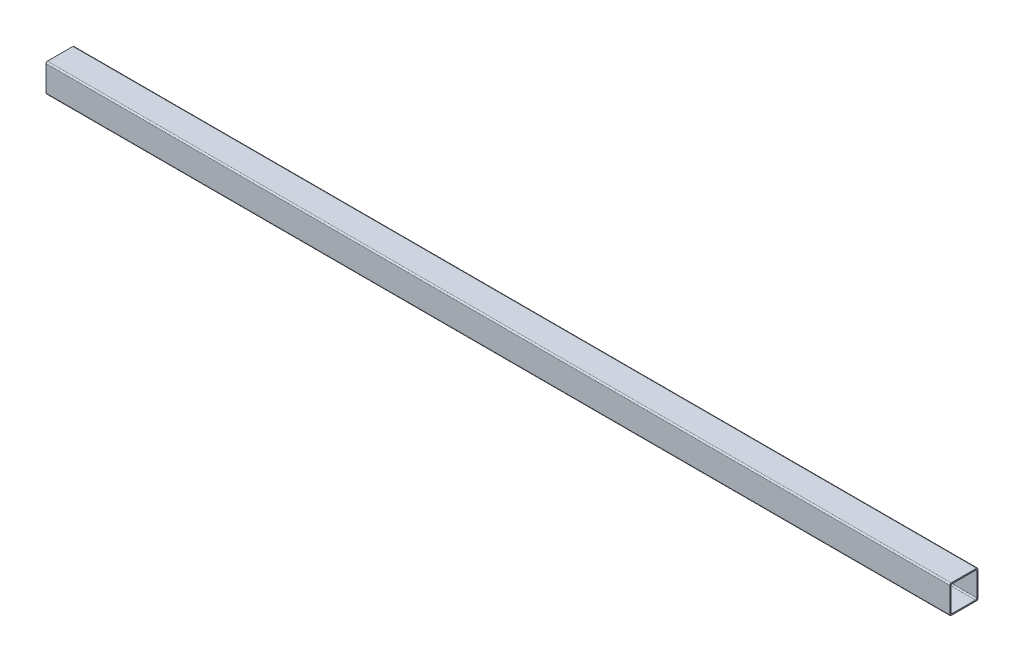
ISO-10303-21;
HEADER;
FILE_DESCRIPTION(('STEP AP214'),'2;1');
FILE_NAME('part.step','',(''),(''),'','','');
FILE_SCHEMA(('AUTOMOTIVE_DESIGN { 1 0 10303 214 1 1 1 1 }'));
ENDSEC;
DATA;
#1=APPLICATION_CONTEXT('core data for automotive mechanical design processes');
#2=APPLICATION_PROTOCOL_DEFINITION('international standard','automotive_design',2000,#1);
#3=PRODUCT_CONTEXT('',#1,'mechanical');
#4=PRODUCT('Part','Part','',(#3));
#5=PRODUCT_RELATED_PRODUCT_CATEGORY('part','',(#4));
#6=PRODUCT_DEFINITION_FORMATION('','',#4);
#7=PRODUCT_DEFINITION_CONTEXT('part definition',#1,'design');
#8=PRODUCT_DEFINITION('design','',#6,#7);
#9=PRODUCT_DEFINITION_SHAPE('','',#8);
#10=(LENGTH_UNIT() NAMED_UNIT(*) SI_UNIT(.MILLI.,.METRE.));
#11=(NAMED_UNIT(*) PLANE_ANGLE_UNIT() SI_UNIT($,.RADIAN.));
#12=(NAMED_UNIT(*) SI_UNIT($,.STERADIAN.) SOLID_ANGLE_UNIT());
#13=UNCERTAINTY_MEASURE_WITH_UNIT(LENGTH_MEASURE(1.E-05),#10,'distance_accuracy_value','');
#14=(GEOMETRIC_REPRESENTATION_CONTEXT(3) GLOBAL_UNCERTAINTY_ASSIGNED_CONTEXT((#13)) GLOBAL_UNIT_ASSIGNED_CONTEXT((#10,
#11,#12)) REPRESENTATION_CONTEXT('',''));
#15=CARTESIAN_POINT('',(0.,0.,0.));
#16=DIRECTION('',(0.,0.,1.));
#17=DIRECTION('',(1.,0.,0.));
#18=AXIS2_PLACEMENT_3D('',#15,#16,#17);
#19=CARTESIAN_POINT('',(914.4,-17.145,-17.145));
#20=DIRECTION('',(1.,0.,0.));
#21=DIRECTION('',(0.,0.,-1.));
#22=AXIS2_PLACEMENT_3D('',#19,#20,#21);
#23=PLANE('',#22);
#24=CARTESIAN_POINT('',(914.4,-17.145,-17.145));
#25=DIRECTION('',(1.,0.,0.));
#26=DIRECTION('',(0.,0.,-1.));
#27=AXIS2_PLACEMENT_3D('',#24,#25,#26);
#28=CIRCLE('',#27,1.905);
#29=CARTESIAN_POINT('',(914.4,-19.05,-17.145));
#30=VERTEX_POINT('',#29);
#31=CARTESIAN_POINT('',(914.4,-17.145,-19.05));
#32=VERTEX_POINT('',#31);
#33=EDGE_CURVE('E218',#30,#32,#28,.T.);
#34=ORIENTED_EDGE('',*,*,#33,.T.);
#35=DIRECTION('',(0.,1.,0.));
#36=VECTOR('',#35,1.);
#37=CARTESIAN_POINT('',(914.4,-17.145,-19.05));
#38=LINE('',#37,#36);
#39=CARTESIAN_POINT('',(914.4,17.145,-19.05));
#40=VERTEX_POINT('',#39);
#41=EDGE_CURVE('E214',#32,#40,#38,.T.);
#42=ORIENTED_EDGE('',*,*,#41,.T.);
#43=CARTESIAN_POINT('',(914.4,17.145,-17.145));
#44=DIRECTION('',(1.,0.,0.));
#45=DIRECTION('',(0.,0.,-1.));
#46=AXIS2_PLACEMENT_3D('',#43,#44,#45);
#47=CIRCLE('',#46,1.905);
#48=CARTESIAN_POINT('',(914.4,19.05,-17.145));
#49=VERTEX_POINT('',#48);
#50=EDGE_CURVE('E288',#40,#49,#47,.T.);
#51=ORIENTED_EDGE('',*,*,#50,.T.);
#52=DIRECTION('',(0.,0.,1.));
#53=VECTOR('',#52,1.);
#54=CARTESIAN_POINT('',(914.4,19.05,-17.145));
#55=LINE('',#54,#53);
#56=CARTESIAN_POINT('',(914.4,19.05,17.145));
#57=VERTEX_POINT('',#56);
#58=EDGE_CURVE('E291',#49,#57,#55,.T.);
#59=ORIENTED_EDGE('',*,*,#58,.T.);
#60=CARTESIAN_POINT('',(914.4,17.145,17.145));
#61=DIRECTION('',(1.,0.,0.));
#62=DIRECTION('',(0.,0.,-1.));
#63=AXIS2_PLACEMENT_3D('',#60,#61,#62);
#64=CIRCLE('',#63,1.905);
#65=CARTESIAN_POINT('',(914.4,17.145,19.05));
#66=VERTEX_POINT('',#65);
#67=EDGE_CURVE('E294',#57,#66,#64,.T.);
#68=ORIENTED_EDGE('',*,*,#67,.T.);
#69=DIRECTION('',(0.,-1.,0.));
#70=VECTOR('',#69,1.);
#71=CARTESIAN_POINT('',(914.4,-17.145,19.05));
#72=LINE('',#71,#70);
#73=CARTESIAN_POINT('',(914.4,-17.145,19.05));
#74=VERTEX_POINT('',#73);
#75=EDGE_CURVE('E297',#66,#74,#72,.T.);
#76=ORIENTED_EDGE('',*,*,#75,.T.);
#77=CARTESIAN_POINT('',(914.4,-17.145,17.145));
#78=DIRECTION('',(1.,0.,0.));
#79=DIRECTION('',(0.,0.,-1.));
#80=AXIS2_PLACEMENT_3D('',#77,#78,#79);
#81=CIRCLE('',#80,1.905);
#82=CARTESIAN_POINT('',(914.4,-19.05,17.145));
#83=VERTEX_POINT('',#82);
#84=EDGE_CURVE('E300',#74,#83,#81,.T.);
#85=ORIENTED_EDGE('',*,*,#84,.T.);
#86=DIRECTION('',(0.,0.,-1.));
#87=VECTOR('',#86,1.);
#88=CARTESIAN_POINT('',(914.4,-19.05,-17.145));
#89=LINE('',#88,#87);
#90=EDGE_CURVE('E181',#83,#30,#89,.T.);
#91=ORIENTED_EDGE('',*,*,#90,.T.);
#92=EDGE_LOOP('',(#34,#42,#51,#59,#68,#76,#85,#91));
#93=FACE_BOUND('',#92,.T.);
#94=DIRECTION('',(0.,0.,1.));
#95=VECTOR('',#94,1.);
#96=CARTESIAN_POINT('',(914.4,17.399,-15.6591));
#97=LINE('',#96,#95);
#98=CARTESIAN_POINT('',(914.4,17.399,-15.6591));
#99=VERTEX_POINT('',#98);
#100=CARTESIAN_POINT('',(914.4,17.399,15.6591));
#101=VERTEX_POINT('',#100);
#102=EDGE_CURVE('E225',#99,#101,#97,.T.);
#103=ORIENTED_EDGE('',*,*,#102,.F.);
#104=CARTESIAN_POINT('',(914.4,15.6591,-15.6591));
#105=DIRECTION('',(1.,0.,0.));
#106=DIRECTION('',(0.,0.,-1.));
#107=AXIS2_PLACEMENT_3D('',#104,#105,#106);
#108=CIRCLE('',#107,1.7399);
#109=CARTESIAN_POINT('',(914.4,15.6591,-17.399));
#110=VERTEX_POINT('',#109);
#111=EDGE_CURVE('E220',#110,#99,#108,.T.);
#112=ORIENTED_EDGE('',*,*,#111,.F.);
#113=DIRECTION('',(0.,1.,0.));
#114=VECTOR('',#113,1.);
#115=CARTESIAN_POINT('',(914.4,15.6591,-17.399));
#116=LINE('',#115,#114);
#117=CARTESIAN_POINT('',(914.4,-15.6591,-17.399));
#118=VERTEX_POINT('',#117);
#119=EDGE_CURVE('E249',#118,#110,#116,.T.);
#120=ORIENTED_EDGE('',*,*,#119,.F.);
#121=CARTESIAN_POINT('',(914.4,-15.6591,-15.6591));
#122=DIRECTION('',(1.,0.,0.));
#123=DIRECTION('',(0.,0.,-1.));
#124=AXIS2_PLACEMENT_3D('',#121,#122,#123);
#125=CIRCLE('',#124,1.7399);
#126=CARTESIAN_POINT('',(914.4,-17.399,-15.6591));
#127=VERTEX_POINT('',#126);
#128=EDGE_CURVE('E245',#127,#118,#125,.T.);
#129=ORIENTED_EDGE('',*,*,#128,.F.);
#130=DIRECTION('',(0.,0.,-1.));
#131=VECTOR('',#130,1.);
#132=CARTESIAN_POINT('',(914.4,-17.399,-15.6591));
#133=LINE('',#132,#131);
#134=CARTESIAN_POINT('',(914.4,-17.399,15.6591));
#135=VERTEX_POINT('',#134);
#136=EDGE_CURVE('E242',#135,#127,#133,.T.);
#137=ORIENTED_EDGE('',*,*,#136,.F.);
#138=CARTESIAN_POINT('',(914.4,-15.6591,15.6591));
#139=DIRECTION('',(1.,0.,0.));
#140=DIRECTION('',(0.,0.,-1.));
#141=AXIS2_PLACEMENT_3D('',#138,#139,#140);
#142=CIRCLE('',#141,1.7399);
#143=CARTESIAN_POINT('',(914.4,-15.6591,17.399));
#144=VERTEX_POINT('',#143);
#145=EDGE_CURVE('E239',#144,#135,#142,.T.);
#146=ORIENTED_EDGE('',*,*,#145,.F.);
#147=DIRECTION('',(0.,-1.,0.));
#148=VECTOR('',#147,1.);
#149=CARTESIAN_POINT('',(914.4,15.6591,17.399));
#150=LINE('',#149,#148);
#151=CARTESIAN_POINT('',(914.4,15.6591,17.399));
#152=VERTEX_POINT('',#151);
#153=EDGE_CURVE('E236',#152,#144,#150,.T.);
#154=ORIENTED_EDGE('',*,*,#153,.F.);
#155=CARTESIAN_POINT('',(914.4,15.6591,15.6591));
#156=DIRECTION('',(1.,0.,0.));
#157=DIRECTION('',(0.,0.,-1.));
#158=AXIS2_PLACEMENT_3D('',#155,#156,#157);
#159=CIRCLE('',#158,1.73990000000001);
#160=EDGE_CURVE('E233',#101,#152,#159,.T.);
#161=ORIENTED_EDGE('',*,*,#160,.F.);
#162=EDGE_LOOP('',(#103,#112,#120,#129,#137,#146,#154,#161));
#163=FACE_BOUND('',#162,.T.);
#164=ADVANCED_FACE('F45',(#93,#163),#23,.T.);
#165=CARTESIAN_POINT('',(914.4,-17.145,-17.145));
#166=DIRECTION('',(-1.,0.,0.));
#167=DIRECTION('',(0.,0.,1.));
#168=AXIS2_PLACEMENT_3D('',#165,#166,#167);
#169=CYLINDRICAL_SURFACE('',#168,1.905);
#170=DIRECTION('',(-1.,0.,0.));
#171=VECTOR('',#170,1.);
#172=CARTESIAN_POINT('',(914.4,-19.05,-17.145));
#173=LINE('',#172,#171);
#174=CARTESIAN_POINT('',(-304.8,-19.05,-17.145));
#175=VERTEX_POINT('',#174);
#176=EDGE_CURVE('E183',#30,#175,#173,.T.);
#177=ORIENTED_EDGE('',*,*,#176,.T.);
#178=CARTESIAN_POINT('',(-304.8,-17.145,-17.145));
#179=DIRECTION('',(1.,0.,0.));
#180=DIRECTION('',(0.,0.,-1.));
#181=AXIS2_PLACEMENT_3D('',#178,#179,#180);
#182=CIRCLE('',#181,1.905);
#183=CARTESIAN_POINT('',(-304.8,-17.145,-19.05));
#184=VERTEX_POINT('',#183);
#185=EDGE_CURVE('E61',#175,#184,#182,.T.);
#186=ORIENTED_EDGE('',*,*,#185,.T.);
#187=DIRECTION('',(-1.,0.,0.));
#188=VECTOR('',#187,1.);
#189=CARTESIAN_POINT('',(914.4,-17.145,-19.05));
#190=LINE('',#189,#188);
#191=EDGE_CURVE('E54',#32,#184,#190,.T.);
#192=ORIENTED_EDGE('',*,*,#191,.F.);
#193=ORIENTED_EDGE('',*,*,#33,.F.);
#194=EDGE_LOOP('',(#177,#186,#192,#193));
#195=FACE_BOUND('',#194,.T.);
#196=ADVANCED_FACE('F47',(#195),#169,.T.);
#197=CARTESIAN_POINT('',(914.4,-17.145,-19.05));
#198=DIRECTION('',(0.,0.,1.));
#199=DIRECTION('',(1.,0.,0.));
#200=AXIS2_PLACEMENT_3D('',#197,#198,#199);
#201=PLANE('',#200);
#202=ORIENTED_EDGE('',*,*,#191,.T.);
#203=DIRECTION('',(0.,-1.,0.));
#204=VECTOR('',#203,1.);
#205=CARTESIAN_POINT('',(-304.8,19.05,-19.05));
#206=LINE('',#205,#204);
#207=CARTESIAN_POINT('',(-304.8,17.145,-19.05));
#208=VERTEX_POINT('',#207);
#209=EDGE_CURVE('E213',#208,#184,#206,.T.);
#210=ORIENTED_EDGE('',*,*,#209,.F.);
#211=DIRECTION('',(-1.,0.,0.));
#212=VECTOR('',#211,1.);
#213=CARTESIAN_POINT('',(914.4,17.145,-19.05));
#214=LINE('',#213,#212);
#215=EDGE_CURVE('E203',#40,#208,#214,.T.);
#216=ORIENTED_EDGE('',*,*,#215,.F.);
#217=ORIENTED_EDGE('',*,*,#41,.F.);
#218=EDGE_LOOP('',(#202,#210,#216,#217));
#219=FACE_BOUND('',#218,.T.);
#220=ADVANCED_FACE('F211',(#219),#201,.F.);
#221=CARTESIAN_POINT('',(914.4,17.145,-17.145));
#222=DIRECTION('',(-1.,0.,0.));
#223=DIRECTION('',(0.,0.,1.));
#224=AXIS2_PLACEMENT_3D('',#221,#222,#223);
#225=CYLINDRICAL_SURFACE('',#224,1.905);
#226=ORIENTED_EDGE('',*,*,#215,.T.);
#227=CARTESIAN_POINT('',(-304.8,17.145,-17.145));
#228=DIRECTION('',(1.,0.,0.));
#229=DIRECTION('',(0.,0.,-1.));
#230=AXIS2_PLACEMENT_3D('',#227,#228,#229);
#231=CIRCLE('',#230,1.905);
#232=CARTESIAN_POINT('',(-304.8,19.05,-17.145));
#233=VERTEX_POINT('',#232);
#234=EDGE_CURVE('E221',#208,#233,#231,.T.);
#235=ORIENTED_EDGE('',*,*,#234,.T.);
#236=DIRECTION('',(-1.,0.,0.));
#237=VECTOR('',#236,1.);
#238=CARTESIAN_POINT('',(914.4,19.05,-17.145));
#239=LINE('',#238,#237);
#240=EDGE_CURVE('E199',#49,#233,#239,.T.);
#241=ORIENTED_EDGE('',*,*,#240,.F.);
#242=ORIENTED_EDGE('',*,*,#50,.F.);
#243=EDGE_LOOP('',(#226,#235,#241,#242));
#244=FACE_BOUND('',#243,.T.);
#245=ADVANCED_FACE('F348',(#244),#225,.T.);
#246=CARTESIAN_POINT('',(914.4,19.05,-17.145));
#247=DIRECTION('',(0.,-1.,0.));
#248=DIRECTION('',(0.,0.,-1.));
#249=AXIS2_PLACEMENT_3D('',#246,#247,#248);
#250=PLANE('',#249);
#251=ORIENTED_EDGE('',*,*,#240,.T.);
#252=DIRECTION('',(0.,0.,1.));
#253=VECTOR('',#252,1.);
#254=CARTESIAN_POINT('',(-304.8,19.05,-19.05));
#255=LINE('',#254,#253);
#256=CARTESIAN_POINT('',(-304.8,19.05,17.145));
#257=VERTEX_POINT('',#256);
#258=EDGE_CURVE('E165',#233,#257,#255,.T.);
#259=ORIENTED_EDGE('',*,*,#258,.T.);
#260=DIRECTION('',(-1.,0.,0.));
#261=VECTOR('',#260,1.);
#262=CARTESIAN_POINT('',(914.4,19.05,17.145));
#263=LINE('',#262,#261);
#264=EDGE_CURVE('E195',#57,#257,#263,.T.);
#265=ORIENTED_EDGE('',*,*,#264,.F.);
#266=ORIENTED_EDGE('',*,*,#58,.F.);
#267=EDGE_LOOP('',(#251,#259,#265,#266));
#268=FACE_BOUND('',#267,.T.);
#269=ADVANCED_FACE('F342',(#268),#250,.F.);
#270=CARTESIAN_POINT('',(914.4,17.145,17.145));
#271=DIRECTION('',(-1.,0.,0.));
#272=DIRECTION('',(0.,0.,1.));
#273=AXIS2_PLACEMENT_3D('',#270,#271,#272);
#274=CYLINDRICAL_SURFACE('',#273,1.905);
#275=ORIENTED_EDGE('',*,*,#264,.T.);
#276=CARTESIAN_POINT('',(-304.8,17.145,17.145));
#277=DIRECTION('',(1.,0.,0.));
#278=DIRECTION('',(0.,0.,-1.));
#279=AXIS2_PLACEMENT_3D('',#276,#277,#278);
#280=CIRCLE('',#279,1.905);
#281=CARTESIAN_POINT('',(-304.8,17.145,19.05));
#282=VERTEX_POINT('',#281);
#283=EDGE_CURVE('E177',#257,#282,#280,.T.);
#284=ORIENTED_EDGE('',*,*,#283,.T.);
#285=DIRECTION('',(-1.,0.,0.));
#286=VECTOR('',#285,1.);
#287=CARTESIAN_POINT('',(914.4,17.145,19.05));
#288=LINE('',#287,#286);
#289=EDGE_CURVE('E187',#66,#282,#288,.T.);
#290=ORIENTED_EDGE('',*,*,#289,.F.);
#291=ORIENTED_EDGE('',*,*,#67,.F.);
#292=EDGE_LOOP('',(#275,#284,#290,#291));
#293=FACE_BOUND('',#292,.T.);
#294=ADVANCED_FACE('F338',(#293),#274,.T.);
#295=CARTESIAN_POINT('',(914.4,-17.145,19.05));
#296=DIRECTION('',(0.,0.,-1.));
#297=DIRECTION('',(-1.,0.,0.));
#298=AXIS2_PLACEMENT_3D('',#295,#296,#297);
#299=PLANE('',#298);
#300=ORIENTED_EDGE('',*,*,#289,.T.);
#301=DIRECTION('',(0.,-1.,0.));
#302=VECTOR('',#301,1.);
#303=CARTESIAN_POINT('',(-304.8,19.05,19.05));
#304=LINE('',#303,#302);
#305=CARTESIAN_POINT('',(-304.8,-17.145,19.05));
#306=VERTEX_POINT('',#305);
#307=EDGE_CURVE('E310',#282,#306,#304,.T.);
#308=ORIENTED_EDGE('',*,*,#307,.T.);
#309=DIRECTION('',(-1.,0.,0.));
#310=VECTOR('',#309,1.);
#311=CARTESIAN_POINT('',(914.4,-17.145,19.05));
#312=LINE('',#311,#310);
#313=EDGE_CURVE('E175',#74,#306,#312,.T.);
#314=ORIENTED_EDGE('',*,*,#313,.F.);
#315=ORIENTED_EDGE('',*,*,#75,.F.);
#316=EDGE_LOOP('',(#300,#308,#314,#315));
#317=FACE_BOUND('',#316,.T.);
#318=ADVANCED_FACE('F309',(#317),#299,.F.);
#319=CARTESIAN_POINT('',(914.4,-17.145,17.145));
#320=DIRECTION('',(-1.,0.,0.));
#321=DIRECTION('',(0.,0.,1.));
#322=AXIS2_PLACEMENT_3D('',#319,#320,#321);
#323=CYLINDRICAL_SURFACE('',#322,1.905);
#324=ORIENTED_EDGE('',*,*,#313,.T.);
#325=CARTESIAN_POINT('',(-304.8,-17.145,17.145));
#326=DIRECTION('',(1.,0.,0.));
#327=DIRECTION('',(0.,0.,-1.));
#328=AXIS2_PLACEMENT_3D('',#325,#326,#327);
#329=CIRCLE('',#328,1.905);
#330=CARTESIAN_POINT('',(-304.8,-19.05,17.145));
#331=VERTEX_POINT('',#330);
#332=EDGE_CURVE('E158',#306,#331,#329,.T.);
#333=ORIENTED_EDGE('',*,*,#332,.T.);
#334=DIRECTION('',(-1.,0.,0.));
#335=VECTOR('',#334,1.);
#336=CARTESIAN_POINT('',(914.4,-19.05,17.145));
#337=LINE('',#336,#335);
#338=EDGE_CURVE('E172',#83,#331,#337,.T.);
#339=ORIENTED_EDGE('',*,*,#338,.F.);
#340=ORIENTED_EDGE('',*,*,#84,.F.);
#341=EDGE_LOOP('',(#324,#333,#339,#340));
#342=FACE_BOUND('',#341,.T.);
#343=ADVANCED_FACE('F170',(#342),#323,.T.);
#344=CARTESIAN_POINT('',(914.4,-19.05,-17.145));
#345=DIRECTION('',(0.,1.,0.));
#346=DIRECTION('',(0.,0.,1.));
#347=AXIS2_PLACEMENT_3D('',#344,#345,#346);
#348=PLANE('',#347);
#349=ORIENTED_EDGE('',*,*,#338,.T.);
#350=DIRECTION('',(0.,0.,1.));
#351=VECTOR('',#350,1.);
#352=CARTESIAN_POINT('',(-304.8,-19.05,-19.05));
#353=LINE('',#352,#351);
#354=EDGE_CURVE('E155',#175,#331,#353,.T.);
#355=ORIENTED_EDGE('',*,*,#354,.F.);
#356=ORIENTED_EDGE('',*,*,#176,.F.);
#357=ORIENTED_EDGE('',*,*,#90,.F.);
#358=EDGE_LOOP('',(#349,#355,#356,#357));
#359=FACE_BOUND('',#358,.T.);
#360=ADVANCED_FACE('F180',(#359),#348,.F.);
#361=CARTESIAN_POINT('',(914.4,15.6591,-15.6591));
#362=DIRECTION('',(-1.,0.,0.));
#363=DIRECTION('',(0.,0.,1.));
#364=AXIS2_PLACEMENT_3D('',#361,#362,#363);
#365=CYLINDRICAL_SURFACE('',#364,1.7399);
#366=CARTESIAN_POINT('',(-304.8,15.6591,-15.6591));
#367=DIRECTION('',(1.,0.,0.));
#368=DIRECTION('',(0.,0.,-1.));
#369=AXIS2_PLACEMENT_3D('',#366,#367,#368);
#370=CIRCLE('',#369,1.7399);
#371=CARTESIAN_POINT('',(-304.8,15.6591,-17.399));
#372=VERTEX_POINT('',#371);
#373=CARTESIAN_POINT('',(-304.8,17.399,-15.6591));
#374=VERTEX_POINT('',#373);
#375=EDGE_CURVE('E178',#372,#374,#370,.T.);
#376=ORIENTED_EDGE('',*,*,#375,.F.);
#377=DIRECTION('',(-1.,0.,0.));
#378=VECTOR('',#377,1.);
#379=CARTESIAN_POINT('',(914.4,15.6591,-17.399));
#380=LINE('',#379,#378);
#381=EDGE_CURVE('E252',#110,#372,#380,.T.);
#382=ORIENTED_EDGE('',*,*,#381,.F.);
#383=ORIENTED_EDGE('',*,*,#111,.T.);
#384=DIRECTION('',(-1.,0.,0.));
#385=VECTOR('',#384,1.);
#386=CARTESIAN_POINT('',(914.4,17.399,-15.6591));
#387=LINE('',#386,#385);
#388=EDGE_CURVE('E280',#99,#374,#387,.T.);
#389=ORIENTED_EDGE('',*,*,#388,.T.);
#390=EDGE_LOOP('',(#376,#382,#383,#389));
#391=FACE_BOUND('',#390,.T.);
#392=ADVANCED_FACE('F364',(#391),#365,.F.);
#393=CARTESIAN_POINT('',(914.4,17.399,-15.6591));
#394=DIRECTION('',(0.,-1.,0.));
#395=DIRECTION('',(0.,0.,-1.));
#396=AXIS2_PLACEMENT_3D('',#393,#394,#395);
#397=PLANE('',#396);
#398=DIRECTION('',(0.,0.,1.));
#399=VECTOR('',#398,1.);
#400=CARTESIAN_POINT('',(-304.8,17.399,-15.6591));
#401=LINE('',#400,#399);
#402=CARTESIAN_POINT('',(-304.8,17.399,15.6591));
#403=VERTEX_POINT('',#402);
#404=EDGE_CURVE('E332',#374,#403,#401,.T.);
#405=ORIENTED_EDGE('',*,*,#404,.F.);
#406=ORIENTED_EDGE('',*,*,#388,.F.);
#407=ORIENTED_EDGE('',*,*,#102,.T.);
#408=DIRECTION('',(-1.,0.,0.));
#409=VECTOR('',#408,1.);
#410=CARTESIAN_POINT('',(914.4,17.399,15.6591));
#411=LINE('',#410,#409);
#412=EDGE_CURVE('E276',#101,#403,#411,.T.);
#413=ORIENTED_EDGE('',*,*,#412,.T.);
#414=EDGE_LOOP('',(#405,#406,#407,#413));
#415=FACE_BOUND('',#414,.T.);
#416=ADVANCED_FACE('F395',(#415),#397,.T.);
#417=CARTESIAN_POINT('',(914.4,15.6591,15.6591));
#418=DIRECTION('',(-1.,0.,0.));
#419=DIRECTION('',(0.,0.,1.));
#420=AXIS2_PLACEMENT_3D('',#417,#418,#419);
#421=CYLINDRICAL_SURFACE('',#420,1.73990000000001);
#422=CARTESIAN_POINT('',(-304.8,15.6591,15.6591));
#423=DIRECTION('',(1.,0.,0.));
#424=DIRECTION('',(0.,0.,-1.));
#425=AXIS2_PLACEMENT_3D('',#422,#423,#424);
#426=CIRCLE('',#425,1.73990000000001);
#427=CARTESIAN_POINT('',(-304.8,15.6591,17.399));
#428=VERTEX_POINT('',#427);
#429=EDGE_CURVE('E329',#403,#428,#426,.T.);
#430=ORIENTED_EDGE('',*,*,#429,.F.);
#431=ORIENTED_EDGE('',*,*,#412,.F.);
#432=ORIENTED_EDGE('',*,*,#160,.T.);
#433=DIRECTION('',(-1.,0.,0.));
#434=VECTOR('',#433,1.);
#435=CARTESIAN_POINT('',(914.4,15.6591,17.399));
#436=LINE('',#435,#434);
#437=EDGE_CURVE('E272',#152,#428,#436,.T.);
#438=ORIENTED_EDGE('',*,*,#437,.T.);
#439=EDGE_LOOP('',(#430,#431,#432,#438));
#440=FACE_BOUND('',#439,.T.);
#441=ADVANCED_FACE('F402',(#440),#421,.F.);
#442=CARTESIAN_POINT('',(914.4,15.6591,17.399));
#443=DIRECTION('',(0.,0.,-1.));
#444=DIRECTION('',(0.,1.,0.));
#445=AXIS2_PLACEMENT_3D('',#442,#443,#444);
#446=PLANE('',#445);
#447=DIRECTION('',(0.,-1.,0.));
#448=VECTOR('',#447,1.);
#449=CARTESIAN_POINT('',(-304.8,15.6591,17.399));
#450=LINE('',#449,#448);
#451=CARTESIAN_POINT('',(-304.8,-15.6591,17.399));
#452=VERTEX_POINT('',#451);
#453=EDGE_CURVE('E326',#428,#452,#450,.T.);
#454=ORIENTED_EDGE('',*,*,#453,.F.);
#455=ORIENTED_EDGE('',*,*,#437,.F.);
#456=ORIENTED_EDGE('',*,*,#153,.T.);
#457=DIRECTION('',(-1.,0.,0.));
#458=VECTOR('',#457,1.);
#459=CARTESIAN_POINT('',(914.4,-15.6591,17.399));
#460=LINE('',#459,#458);
#461=EDGE_CURVE('E268',#144,#452,#460,.T.);
#462=ORIENTED_EDGE('',*,*,#461,.T.);
#463=EDGE_LOOP('',(#454,#455,#456,#462));
#464=FACE_BOUND('',#463,.T.);
#465=ADVANCED_FACE('F409',(#464),#446,.T.);
#466=CARTESIAN_POINT('',(914.4,-15.6591,15.6591));
#467=DIRECTION('',(-1.,0.,0.));
#468=DIRECTION('',(0.,0.,1.));
#469=AXIS2_PLACEMENT_3D('',#466,#467,#468);
#470=CYLINDRICAL_SURFACE('',#469,1.7399);
#471=CARTESIAN_POINT('',(-304.8,-15.6591,15.6591));
#472=DIRECTION('',(1.,0.,0.));
#473=DIRECTION('',(0.,0.,-1.));
#474=AXIS2_PLACEMENT_3D('',#471,#472,#473);
#475=CIRCLE('',#474,1.7399);
#476=CARTESIAN_POINT('',(-304.8,-17.399,15.6591));
#477=VERTEX_POINT('',#476);
#478=EDGE_CURVE('E323',#452,#477,#475,.T.);
#479=ORIENTED_EDGE('',*,*,#478,.F.);
#480=ORIENTED_EDGE('',*,*,#461,.F.);
#481=ORIENTED_EDGE('',*,*,#145,.T.);
#482=DIRECTION('',(-1.,0.,0.));
#483=VECTOR('',#482,1.);
#484=CARTESIAN_POINT('',(914.4,-17.399,15.6591));
#485=LINE('',#484,#483);
#486=EDGE_CURVE('E264',#135,#477,#485,.T.);
#487=ORIENTED_EDGE('',*,*,#486,.T.);
#488=EDGE_LOOP('',(#479,#480,#481,#487));
#489=FACE_BOUND('',#488,.T.);
#490=ADVANCED_FACE('F417',(#489),#470,.F.);
#491=CARTESIAN_POINT('',(914.4,-17.399,-15.6591));
#492=DIRECTION('',(0.,1.,0.));
#493=DIRECTION('',(0.,0.,1.));
#494=AXIS2_PLACEMENT_3D('',#491,#492,#493);
#495=PLANE('',#494);
#496=DIRECTION('',(0.,0.,-1.));
#497=VECTOR('',#496,1.);
#498=CARTESIAN_POINT('',(-304.8,-17.399,-15.6591));
#499=LINE('',#498,#497);
#500=CARTESIAN_POINT('',(-304.8,-17.399,-15.6591));
#501=VERTEX_POINT('',#500);
#502=EDGE_CURVE('E316',#477,#501,#499,.T.);
#503=ORIENTED_EDGE('',*,*,#502,.F.);
#504=ORIENTED_EDGE('',*,*,#486,.F.);
#505=ORIENTED_EDGE('',*,*,#136,.T.);
#506=DIRECTION('',(-1.,0.,0.));
#507=VECTOR('',#506,1.);
#508=CARTESIAN_POINT('',(914.4,-17.399,-15.6591));
#509=LINE('',#508,#507);
#510=EDGE_CURVE('E260',#127,#501,#509,.T.);
#511=ORIENTED_EDGE('',*,*,#510,.T.);
#512=EDGE_LOOP('',(#503,#504,#505,#511));
#513=FACE_BOUND('',#512,.T.);
#514=ADVANCED_FACE('F425',(#513),#495,.T.);
#515=CARTESIAN_POINT('',(914.4,-15.6591,-15.6591));
#516=DIRECTION('',(-1.,0.,0.));
#517=DIRECTION('',(0.,0.,1.));
#518=AXIS2_PLACEMENT_3D('',#515,#516,#517);
#519=CYLINDRICAL_SURFACE('',#518,1.7399);
#520=CARTESIAN_POINT('',(-304.8,-15.6591,-15.6591));
#521=DIRECTION('',(1.,0.,0.));
#522=DIRECTION('',(0.,0.,-1.));
#523=AXIS2_PLACEMENT_3D('',#520,#521,#522);
#524=CIRCLE('',#523,1.7399);
#525=CARTESIAN_POINT('',(-304.8,-15.6591,-17.399));
#526=VERTEX_POINT('',#525);
#527=EDGE_CURVE('E68',#501,#526,#524,.T.);
#528=ORIENTED_EDGE('',*,*,#527,.F.);
#529=ORIENTED_EDGE('',*,*,#510,.F.);
#530=ORIENTED_EDGE('',*,*,#128,.T.);
#531=DIRECTION('',(-1.,0.,0.));
#532=VECTOR('',#531,1.);
#533=CARTESIAN_POINT('',(914.4,-15.6591,-17.399));
#534=LINE('',#533,#532);
#535=EDGE_CURVE('E256',#118,#526,#534,.T.);
#536=ORIENTED_EDGE('',*,*,#535,.T.);
#537=EDGE_LOOP('',(#528,#529,#530,#536));
#538=FACE_BOUND('',#537,.T.);
#539=ADVANCED_FACE('F433',(#538),#519,.F.);
#540=CARTESIAN_POINT('',(914.4,15.6591,-17.399));
#541=DIRECTION('',(0.,0.,1.));
#542=DIRECTION('',(1.,0.,0.));
#543=AXIS2_PLACEMENT_3D('',#540,#541,#542);
#544=PLANE('',#543);
#545=DIRECTION('',(0.,1.,0.));
#546=VECTOR('',#545,1.);
#547=CARTESIAN_POINT('',(-304.8,15.6591,-17.399));
#548=LINE('',#547,#546);
#549=EDGE_CURVE('E11',#526,#372,#548,.T.);
#550=ORIENTED_EDGE('',*,*,#549,.F.);
#551=ORIENTED_EDGE('',*,*,#535,.F.);
#552=ORIENTED_EDGE('',*,*,#119,.T.);
#553=ORIENTED_EDGE('',*,*,#381,.T.);
#554=EDGE_LOOP('',(#550,#551,#552,#553));
#555=FACE_BOUND('',#554,.T.);
#556=ADVANCED_FACE('F441',(#555),#544,.T.);
#557=CARTESIAN_POINT('',(-304.8,19.05,-19.05));
#558=DIRECTION('',(1.,0.,0.));
#559=DIRECTION('',(0.,0.,-1.));
#560=AXIS2_PLACEMENT_3D('',#557,#558,#559);
#561=PLANE('',#560);
#562=ORIENTED_EDGE('',*,*,#375,.T.);
#563=ORIENTED_EDGE('',*,*,#404,.T.);
#564=ORIENTED_EDGE('',*,*,#429,.T.);
#565=ORIENTED_EDGE('',*,*,#453,.T.);
#566=ORIENTED_EDGE('',*,*,#478,.T.);
#567=ORIENTED_EDGE('',*,*,#502,.T.);
#568=ORIENTED_EDGE('',*,*,#527,.T.);
#569=ORIENTED_EDGE('',*,*,#549,.T.);
#570=EDGE_LOOP('',(#562,#563,#564,#565,#566,#567,#568,#569));
#571=FACE_BOUND('',#570,.T.);
#572=ORIENTED_EDGE('',*,*,#354,.T.);
#573=ORIENTED_EDGE('',*,*,#332,.F.);
#574=ORIENTED_EDGE('',*,*,#307,.F.);
#575=ORIENTED_EDGE('',*,*,#283,.F.);
#576=ORIENTED_EDGE('',*,*,#258,.F.);
#577=ORIENTED_EDGE('',*,*,#234,.F.);
#578=ORIENTED_EDGE('',*,*,#209,.T.);
#579=ORIENTED_EDGE('',*,*,#185,.F.);
#580=EDGE_LOOP('',(#572,#573,#574,#575,#576,#577,#578,#579));
#581=FACE_BOUND('',#580,.T.);
#582=ADVANCED_FACE('F157',(#571,#581),#561,.F.);
#583=CLOSED_SHELL('',(#164,#196,#220,#245,#269,#294,#318,#343,#360,#392,#416,#441,#465,#490,
#514,#539,#556,#582));
#584=MANIFOLD_SOLID_BREP('B2',#583);
#585=ADVANCED_BREP_SHAPE_REPRESENTATION('',(#18,#584),#14);
#586=SHAPE_DEFINITION_REPRESENTATION(#9,#585);
ENDSEC;
END-ISO-10303-21;
